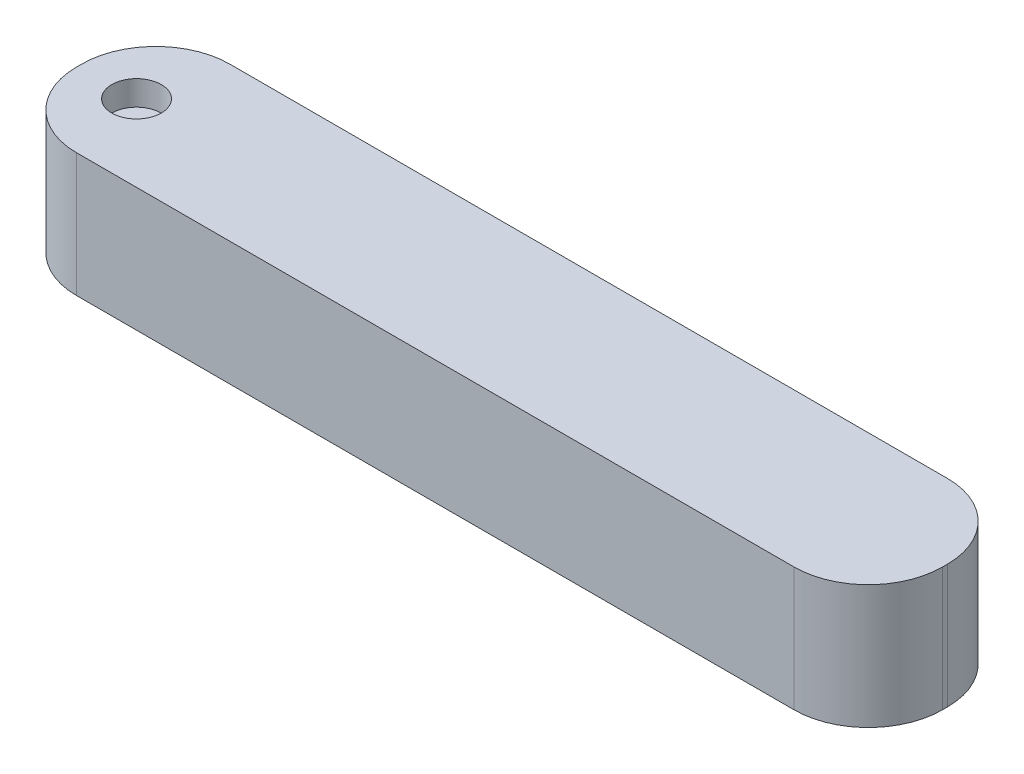
ISO-10303-21;
HEADER;
FILE_DESCRIPTION(('STEP AP214'),'2;1');
FILE_NAME('part.step','',(''),(''),'','','');
FILE_SCHEMA(('AUTOMOTIVE_DESIGN { 1 0 10303 214 1 1 1 1 }'));
ENDSEC;
DATA;
#1=APPLICATION_CONTEXT('core data for automotive mechanical design processes');
#2=APPLICATION_PROTOCOL_DEFINITION('international standard','automotive_design',2000,#1);
#3=PRODUCT_CONTEXT('',#1,'mechanical');
#4=PRODUCT('Part','Part','',(#3));
#5=PRODUCT_RELATED_PRODUCT_CATEGORY('part','',(#4));
#6=PRODUCT_DEFINITION_FORMATION('','',#4);
#7=PRODUCT_DEFINITION_CONTEXT('part definition',#1,'design');
#8=PRODUCT_DEFINITION('design','',#6,#7);
#9=PRODUCT_DEFINITION_SHAPE('','',#8);
#10=(LENGTH_UNIT() NAMED_UNIT(*) SI_UNIT(.MILLI.,.METRE.));
#11=(NAMED_UNIT(*) PLANE_ANGLE_UNIT() SI_UNIT($,.RADIAN.));
#12=(NAMED_UNIT(*) SI_UNIT($,.STERADIAN.) SOLID_ANGLE_UNIT());
#13=UNCERTAINTY_MEASURE_WITH_UNIT(LENGTH_MEASURE(1.E-05),#10,'distance_accuracy_value','');
#14=(GEOMETRIC_REPRESENTATION_CONTEXT(3) GLOBAL_UNCERTAINTY_ASSIGNED_CONTEXT((#13)) GLOBAL_UNIT_ASSIGNED_CONTEXT((#10,
#11,#12)) REPRESENTATION_CONTEXT('',''));
#15=CARTESIAN_POINT('',(0.,0.,0.));
#16=DIRECTION('',(0.,0.,1.));
#17=DIRECTION('',(1.,0.,0.));
#18=AXIS2_PLACEMENT_3D('',#15,#16,#17);
#19=CARTESIAN_POINT('',(-32.3318438914027,12.7,-11.1125));
#20=DIRECTION('',(1.,0.,0.));
#21=DIRECTION('',(0.,0.,-1.));
#22=AXIS2_PLACEMENT_3D('',#19,#20,#21);
#23=PLANE('',#22);
#24=DIRECTION('',(0.,0.,1.));
#25=VECTOR('',#24,1.);
#26=CARTESIAN_POINT('',(-32.3318438914027,12.7,-11.1125));
#27=LINE('',#26,#25);
#28=CARTESIAN_POINT('',(-32.3318438914027,12.7,-3.4925));
#29=VERTEX_POINT('',#28);
#30=CARTESIAN_POINT('',(-32.3318438914027,12.7,-2.9845));
#31=VERTEX_POINT('',#30);
#32=EDGE_CURVE('E129',#29,#31,#27,.T.);
#33=ORIENTED_EDGE('',*,*,#32,.F.);
#34=DIRECTION('',(0.,-1.,0.));
#35=VECTOR('',#34,1.);
#36=CARTESIAN_POINT('',(-32.3318438914027,12.7,-3.4925));
#37=LINE('',#36,#35);
#38=CARTESIAN_POINT('',(-32.3318438914027,0.,-3.4925));
#39=VERTEX_POINT('',#38);
#40=EDGE_CURVE('E113',#29,#39,#37,.T.);
#41=ORIENTED_EDGE('',*,*,#40,.T.);
#42=DIRECTION('',(0.,0.,1.));
#43=VECTOR('',#42,1.);
#44=CARTESIAN_POINT('',(-32.3318438914027,0.,-11.1125));
#45=LINE('',#44,#43);
#46=CARTESIAN_POINT('',(-32.3318438914027,0.,-2.9845));
#47=VERTEX_POINT('',#46);
#48=EDGE_CURVE('E126',#39,#47,#45,.T.);
#49=ORIENTED_EDGE('',*,*,#48,.T.);
#50=DIRECTION('',(0.,-1.,0.));
#51=VECTOR('',#50,1.);
#52=CARTESIAN_POINT('',(-32.3318438914027,12.7,-2.9845));
#53=LINE('',#52,#51);
#54=EDGE_CURVE('E132',#47,#31,#53,.F.);
#55=ORIENTED_EDGE('',*,*,#54,.T.);
#56=EDGE_LOOP('',(#33,#41,#49,#55));
#57=FACE_BOUND('',#56,.T.);
#58=ADVANCED_FACE('F42',(#57),#23,.F.);
#59=CARTESIAN_POINT('',(-32.3318438914027,12.7,4.6355));
#60=DIRECTION('',(0.,0.,-1.));
#61=DIRECTION('',(-1.,0.,0.));
#62=AXIS2_PLACEMENT_3D('',#59,#60,#61);
#63=PLANE('',#62);
#64=DIRECTION('',(1.,0.,0.));
#65=VECTOR('',#64,1.);
#66=CARTESIAN_POINT('',(-32.3318438914027,12.7,4.6355));
#67=LINE('',#66,#65);
#68=CARTESIAN_POINT('',(-24.7118438914027,12.7,4.6355));
#69=VERTEX_POINT('',#68);
#70=CARTESIAN_POINT('',(48.9481561085973,12.7,4.6355));
#71=VERTEX_POINT('',#70);
#72=EDGE_CURVE('E206',#69,#71,#67,.T.);
#73=ORIENTED_EDGE('',*,*,#72,.F.);
#74=DIRECTION('',(0.,-1.,0.));
#75=VECTOR('',#74,1.);
#76=CARTESIAN_POINT('',(-24.7118438914027,12.7,4.6355));
#77=LINE('',#76,#75);
#78=CARTESIAN_POINT('',(-24.7118438914027,0.,4.6355));
#79=VERTEX_POINT('',#78);
#80=EDGE_CURVE('E185',#69,#79,#77,.T.);
#81=ORIENTED_EDGE('',*,*,#80,.T.);
#82=DIRECTION('',(1.,0.,0.));
#83=VECTOR('',#82,1.);
#84=CARTESIAN_POINT('',(-32.3318438914027,0.,4.6355));
#85=LINE('',#84,#83);
#86=CARTESIAN_POINT('',(48.9481561085973,0.,4.6355));
#87=VERTEX_POINT('',#86);
#88=EDGE_CURVE('E137',#79,#87,#85,.T.);
#89=ORIENTED_EDGE('',*,*,#88,.T.);
#90=DIRECTION('',(0.,-1.,0.));
#91=VECTOR('',#90,1.);
#92=CARTESIAN_POINT('',(48.9481561085973,12.7,4.6355));
#93=LINE('',#92,#91);
#94=EDGE_CURVE('E182',#87,#71,#93,.F.);
#95=ORIENTED_EDGE('',*,*,#94,.T.);
#96=EDGE_LOOP('',(#73,#81,#89,#95));
#97=FACE_BOUND('',#96,.T.);
#98=ADVANCED_FACE('F262',(#97),#63,.F.);
#99=CARTESIAN_POINT('',(56.5681561085973,12.7,-11.1125));
#100=DIRECTION('',(-1.,0.,0.));
#101=DIRECTION('',(0.,0.,1.));
#102=AXIS2_PLACEMENT_3D('',#99,#100,#101);
#103=PLANE('',#102);
#104=DIRECTION('',(0.,0.,-1.));
#105=VECTOR('',#104,1.);
#106=CARTESIAN_POINT('',(56.5681561085973,0.,-11.1125));
#107=LINE('',#106,#105);
#108=CARTESIAN_POINT('',(56.5681561085973,0.,-2.9845));
#109=VERTEX_POINT('',#108);
#110=CARTESIAN_POINT('',(56.5681561085973,0.,-3.4925));
#111=VERTEX_POINT('',#110);
#112=EDGE_CURVE('E143',#109,#111,#107,.T.);
#113=ORIENTED_EDGE('',*,*,#112,.T.);
#114=DIRECTION('',(0.,-1.,0.));
#115=VECTOR('',#114,1.);
#116=CARTESIAN_POINT('',(56.5681561085973,12.7,-3.4925));
#117=LINE('',#116,#115);
#118=CARTESIAN_POINT('',(56.5681561085973,12.7,-3.4925));
#119=VERTEX_POINT('',#118);
#120=EDGE_CURVE('E11',#111,#119,#117,.F.);
#121=ORIENTED_EDGE('',*,*,#120,.T.);
#122=DIRECTION('',(0.,0.,-1.));
#123=VECTOR('',#122,1.);
#124=CARTESIAN_POINT('',(56.5681561085973,12.7,-11.1125));
#125=LINE('',#124,#123);
#126=CARTESIAN_POINT('',(56.5681561085973,12.7,-2.9845));
#127=VERTEX_POINT('',#126);
#128=EDGE_CURVE('E194',#127,#119,#125,.T.);
#129=ORIENTED_EDGE('',*,*,#128,.F.);
#130=DIRECTION('',(0.,-1.,0.));
#131=VECTOR('',#130,1.);
#132=CARTESIAN_POINT('',(56.5681561085973,12.7,-2.9845));
#133=LINE('',#132,#131);
#134=EDGE_CURVE('E52',#127,#109,#133,.T.);
#135=ORIENTED_EDGE('',*,*,#134,.T.);
#136=EDGE_LOOP('',(#113,#121,#129,#135));
#137=FACE_BOUND('',#136,.T.);
#138=ADVANCED_FACE('F193',(#137),#103,.F.);
#139=CARTESIAN_POINT('',(-32.3318438914027,12.7,-11.1125));
#140=DIRECTION('',(0.,0.,1.));
#141=DIRECTION('',(1.,0.,0.));
#142=AXIS2_PLACEMENT_3D('',#139,#140,#141);
#143=PLANE('',#142);
#144=DIRECTION('',(-1.,0.,0.));
#145=VECTOR('',#144,1.);
#146=CARTESIAN_POINT('',(-32.3318438914027,0.,-11.1125));
#147=LINE('',#146,#145);
#148=CARTESIAN_POINT('',(48.9481561085973,0.,-11.1125));
#149=VERTEX_POINT('',#148);
#150=CARTESIAN_POINT('',(-24.7118438914027,0.,-11.1125));
#151=VERTEX_POINT('',#150);
#152=EDGE_CURVE('E154',#149,#151,#147,.T.);
#153=ORIENTED_EDGE('',*,*,#152,.T.);
#154=DIRECTION('',(0.,-1.,0.));
#155=VECTOR('',#154,1.);
#156=CARTESIAN_POINT('',(-24.7118438914027,12.7,-11.1125));
#157=LINE('',#156,#155);
#158=CARTESIAN_POINT('',(-24.7118438914027,12.7,-11.1125));
#159=VERTEX_POINT('',#158);
#160=EDGE_CURVE('E114',#151,#159,#157,.F.);
#161=ORIENTED_EDGE('',*,*,#160,.T.);
#162=DIRECTION('',(-1.,0.,0.));
#163=VECTOR('',#162,1.);
#164=CARTESIAN_POINT('',(-32.3318438914027,12.7,-11.1125));
#165=LINE('',#164,#163);
#166=CARTESIAN_POINT('',(48.9481561085973,12.7,-11.1125));
#167=VERTEX_POINT('',#166);
#168=EDGE_CURVE('E149',#167,#159,#165,.T.);
#169=ORIENTED_EDGE('',*,*,#168,.F.);
#170=DIRECTION('',(0.,-1.,0.));
#171=VECTOR('',#170,1.);
#172=CARTESIAN_POINT('',(48.9481561085973,12.7,-11.1125));
#173=LINE('',#172,#171);
#174=EDGE_CURVE('E120',#167,#149,#173,.T.);
#175=ORIENTED_EDGE('',*,*,#174,.T.);
#176=EDGE_LOOP('',(#153,#161,#169,#175));
#177=FACE_BOUND('',#176,.T.);
#178=ADVANCED_FACE('F202',(#177),#143,.F.);
#179=CARTESIAN_POINT('',(0.,12.7,0.));
#180=DIRECTION('',(0.,1.,0.));
#181=DIRECTION('',(0.,0.,1.));
#182=AXIS2_PLACEMENT_3D('',#179,#180,#181);
#183=PLANE('',#182);
#184=CARTESIAN_POINT('',(-26.4287123427932,12.7,-3.2385));
#185=DIRECTION('',(0.,1.,0.));
#186=DIRECTION('',(0.,0.,1.));
#187=AXIS2_PLACEMENT_3D('',#184,#185,#186);
#188=CIRCLE('',#187,2.54);
#189=CARTESIAN_POINT('',(-26.4287123427932,12.7,-0.698499999999996));
#190=VERTEX_POINT('',#189);
#191=EDGE_CURVE('E146',#190,#190,#188,.T.);
#192=ORIENTED_EDGE('',*,*,#191,.F.);
#193=EDGE_LOOP('',(#192));
#194=FACE_BOUND('',#193,.T.);
#195=ORIENTED_EDGE('',*,*,#168,.T.);
#196=CARTESIAN_POINT('',(-24.7118438914027,12.7,-3.4925));
#197=DIRECTION('',(0.,1.,0.));
#198=DIRECTION('',(0.,0.,1.));
#199=AXIS2_PLACEMENT_3D('',#196,#197,#198);
#200=CIRCLE('',#199,7.62);
#201=EDGE_CURVE('E179',#159,#29,#200,.T.);
#202=ORIENTED_EDGE('',*,*,#201,.T.);
#203=ORIENTED_EDGE('',*,*,#32,.T.);
#204=CARTESIAN_POINT('',(-24.7118438914027,12.7,-2.9845));
#205=DIRECTION('',(0.,1.,0.));
#206=DIRECTION('',(0.,0.,1.));
#207=AXIS2_PLACEMENT_3D('',#204,#205,#206);
#208=CIRCLE('',#207,7.62);
#209=EDGE_CURVE('E176',#31,#69,#208,.T.);
#210=ORIENTED_EDGE('',*,*,#209,.T.);
#211=ORIENTED_EDGE('',*,*,#72,.T.);
#212=CARTESIAN_POINT('',(48.9481561085973,12.7,-2.9845));
#213=DIRECTION('',(0.,1.,0.));
#214=DIRECTION('',(0.,0.,1.));
#215=AXIS2_PLACEMENT_3D('',#212,#213,#214);
#216=CIRCLE('',#215,7.62);
#217=EDGE_CURVE('E64',#71,#127,#216,.T.);
#218=ORIENTED_EDGE('',*,*,#217,.T.);
#219=ORIENTED_EDGE('',*,*,#128,.T.);
#220=CARTESIAN_POINT('',(48.9481561085973,12.7,-3.4925));
#221=DIRECTION('',(0.,1.,0.));
#222=DIRECTION('',(0.,0.,1.));
#223=AXIS2_PLACEMENT_3D('',#220,#221,#222);
#224=CIRCLE('',#223,7.62);
#225=EDGE_CURVE('E173',#119,#167,#224,.T.);
#226=ORIENTED_EDGE('',*,*,#225,.T.);
#227=EDGE_LOOP('',(#195,#202,#203,#210,#211,#218,#219,#226));
#228=FACE_BOUND('',#227,.T.);
#229=ADVANCED_FACE('F248',(#194,#228),#183,.T.);
#230=CARTESIAN_POINT('',(0.,0.,0.));
#231=DIRECTION('',(0.,1.,0.));
#232=DIRECTION('',(0.,0.,1.));
#233=AXIS2_PLACEMENT_3D('',#230,#231,#232);
#234=PLANE('',#233);
#235=CARTESIAN_POINT('',(-26.4287123427932,0.,-3.2385));
#236=DIRECTION('',(0.,-1.,0.));
#237=DIRECTION('',(0.,0.,-1.));
#238=AXIS2_PLACEMENT_3D('',#235,#236,#237);
#239=CIRCLE('',#238,2.54);
#240=CARTESIAN_POINT('',(-26.4287123427932,0.,-5.7785));
#241=VERTEX_POINT('',#240);
#242=EDGE_CURVE('E216',#241,#241,#239,.T.);
#243=ORIENTED_EDGE('',*,*,#242,.F.);
#244=EDGE_LOOP('',(#243));
#245=FACE_BOUND('',#244,.T.);
#246=ORIENTED_EDGE('',*,*,#48,.F.);
#247=CARTESIAN_POINT('',(-24.7118438914027,0.,-3.4925));
#248=DIRECTION('',(0.,1.,0.));
#249=DIRECTION('',(0.,0.,1.));
#250=AXIS2_PLACEMENT_3D('',#247,#248,#249);
#251=CIRCLE('',#250,7.62);
#252=EDGE_CURVE('E109',#39,#151,#251,.F.);
#253=ORIENTED_EDGE('',*,*,#252,.T.);
#254=ORIENTED_EDGE('',*,*,#152,.F.);
#255=CARTESIAN_POINT('',(48.9481561085973,0.,-3.4925));
#256=DIRECTION('',(0.,1.,0.));
#257=DIRECTION('',(0.,0.,1.));
#258=AXIS2_PLACEMENT_3D('',#255,#256,#257);
#259=CIRCLE('',#258,7.62);
#260=EDGE_CURVE('E161',#149,#111,#259,.F.);
#261=ORIENTED_EDGE('',*,*,#260,.T.);
#262=ORIENTED_EDGE('',*,*,#112,.F.);
#263=CARTESIAN_POINT('',(48.9481561085973,0.,-2.9845));
#264=DIRECTION('',(0.,1.,0.));
#265=DIRECTION('',(0.,0.,1.));
#266=AXIS2_PLACEMENT_3D('',#263,#264,#265);
#267=CIRCLE('',#266,7.62);
#268=EDGE_CURVE('E131',#109,#87,#267,.F.);
#269=ORIENTED_EDGE('',*,*,#268,.T.);
#270=ORIENTED_EDGE('',*,*,#88,.F.);
#271=CARTESIAN_POINT('',(-24.7118438914027,0.,-2.9845));
#272=DIRECTION('',(0.,1.,0.));
#273=DIRECTION('',(0.,0.,1.));
#274=AXIS2_PLACEMENT_3D('',#271,#272,#273);
#275=CIRCLE('',#274,7.62);
#276=EDGE_CURVE('E121',#79,#47,#275,.F.);
#277=ORIENTED_EDGE('',*,*,#276,.T.);
#278=EDGE_LOOP('',(#246,#253,#254,#261,#262,#269,#270,#277));
#279=FACE_BOUND('',#278,.T.);
#280=ADVANCED_FACE('F134',(#245,#279),#234,.F.);
#281=CARTESIAN_POINT('',(-24.7118438914027,12.7,-3.4925));
#282=DIRECTION('',(0.,-1.,0.));
#283=DIRECTION('',(0.,0.,-1.));
#284=AXIS2_PLACEMENT_3D('',#281,#282,#283);
#285=CYLINDRICAL_SURFACE('',#284,7.62);
#286=ORIENTED_EDGE('',*,*,#201,.F.);
#287=ORIENTED_EDGE('',*,*,#160,.F.);
#288=ORIENTED_EDGE('',*,*,#252,.F.);
#289=ORIENTED_EDGE('',*,*,#40,.F.);
#290=EDGE_LOOP('',(#286,#287,#288,#289));
#291=FACE_BOUND('',#290,.T.);
#292=ADVANCED_FACE('F112',(#291),#285,.T.);
#293=CARTESIAN_POINT('',(-24.7118438914027,12.7,-2.9845));
#294=DIRECTION('',(0.,-1.,0.));
#295=DIRECTION('',(0.,0.,-1.));
#296=AXIS2_PLACEMENT_3D('',#293,#294,#295);
#297=CYLINDRICAL_SURFACE('',#296,7.62);
#298=ORIENTED_EDGE('',*,*,#209,.F.);
#299=ORIENTED_EDGE('',*,*,#54,.F.);
#300=ORIENTED_EDGE('',*,*,#276,.F.);
#301=ORIENTED_EDGE('',*,*,#80,.F.);
#302=EDGE_LOOP('',(#298,#299,#300,#301));
#303=FACE_BOUND('',#302,.T.);
#304=ADVANCED_FACE('F255',(#303),#297,.T.);
#305=CARTESIAN_POINT('',(48.9481561085973,12.7,-3.4925));
#306=DIRECTION('',(0.,-1.,0.));
#307=DIRECTION('',(0.,0.,-1.));
#308=AXIS2_PLACEMENT_3D('',#305,#306,#307);
#309=CYLINDRICAL_SURFACE('',#308,7.62);
#310=ORIENTED_EDGE('',*,*,#225,.F.);
#311=ORIENTED_EDGE('',*,*,#120,.F.);
#312=ORIENTED_EDGE('',*,*,#260,.F.);
#313=ORIENTED_EDGE('',*,*,#174,.F.);
#314=EDGE_LOOP('',(#310,#311,#312,#313));
#315=FACE_BOUND('',#314,.T.);
#316=ADVANCED_FACE('F199',(#315),#309,.T.);
#317=CARTESIAN_POINT('',(48.9481561085973,12.7,-2.9845));
#318=DIRECTION('',(0.,-1.,0.));
#319=DIRECTION('',(0.,0.,-1.));
#320=AXIS2_PLACEMENT_3D('',#317,#318,#319);
#321=CYLINDRICAL_SURFACE('',#320,7.62);
#322=ORIENTED_EDGE('',*,*,#217,.F.);
#323=ORIENTED_EDGE('',*,*,#94,.F.);
#324=ORIENTED_EDGE('',*,*,#268,.F.);
#325=ORIENTED_EDGE('',*,*,#134,.F.);
#326=EDGE_LOOP('',(#322,#323,#324,#325));
#327=FACE_BOUND('',#326,.T.);
#328=ADVANCED_FACE('F44',(#327),#321,.T.);
#329=CARTESIAN_POINT('',(-26.4287123427932,10.16,-3.2385));
#330=DIRECTION('',(0.,1.,0.));
#331=DIRECTION('',(0.,0.,1.));
#332=AXIS2_PLACEMENT_3D('',#329,#330,#331);
#333=CYLINDRICAL_SURFACE('',#332,2.54);
#334=CARTESIAN_POINT('',(-26.4287123427932,10.16,-3.2385));
#335=DIRECTION('',(0.,1.,0.));
#336=DIRECTION('',(0.,0.,1.));
#337=AXIS2_PLACEMENT_3D('',#334,#335,#336);
#338=CIRCLE('',#337,2.54);
#339=CARTESIAN_POINT('',(-26.4287123427932,10.16,-0.698499999999996));
#340=VERTEX_POINT('',#339);
#341=EDGE_CURVE('E138',#340,#340,#338,.T.);
#342=ORIENTED_EDGE('',*,*,#341,.F.);
#343=EDGE_LOOP('',(#342));
#344=FACE_BOUND('',#343,.T.);
#345=ORIENTED_EDGE('',*,*,#191,.T.);
#346=EDGE_LOOP('',(#345));
#347=FACE_BOUND('',#346,.T.);
#348=ADVANCED_FACE('F277',(#344,#347),#333,.F.);
#349=CARTESIAN_POINT('',(-26.4287123427932,10.16,-3.2385));
#350=DIRECTION('',(0.,1.,0.));
#351=DIRECTION('',(0.,0.,1.));
#352=AXIS2_PLACEMENT_3D('',#349,#350,#351);
#353=PLANE('',#352);
#354=CARTESIAN_POINT('',(-26.4287123427932,10.16,-3.2385));
#355=DIRECTION('',(0.,1.,0.));
#356=DIRECTION('',(0.,0.,1.));
#357=AXIS2_PLACEMENT_3D('',#354,#355,#356);
#358=CIRCLE('',#357,1.016);
#359=CARTESIAN_POINT('',(-26.4287123427932,10.16,-2.2225));
#360=VERTEX_POINT('',#359);
#361=EDGE_CURVE('E223',#360,#360,#358,.T.);
#362=ORIENTED_EDGE('',*,*,#361,.F.);
#363=EDGE_LOOP('',(#362));
#364=FACE_BOUND('',#363,.T.);
#365=ORIENTED_EDGE('',*,*,#341,.T.);
#366=EDGE_LOOP('',(#365));
#367=FACE_BOUND('',#366,.T.);
#368=ADVANCED_FACE('F243',(#364,#367),#353,.T.);
#369=CARTESIAN_POINT('',(-26.4287123427932,7.62,-3.2385));
#370=DIRECTION('',(0.,-1.,0.));
#371=DIRECTION('',(0.,0.,-1.));
#372=AXIS2_PLACEMENT_3D('',#369,#370,#371);
#373=CYLINDRICAL_SURFACE('',#372,2.54);
#374=CARTESIAN_POINT('',(-26.4287123427932,7.62,-3.2385));
#375=DIRECTION('',(0.,-1.,0.));
#376=DIRECTION('',(0.,0.,-1.));
#377=AXIS2_PLACEMENT_3D('',#374,#375,#376);
#378=CIRCLE('',#377,2.54);
#379=CARTESIAN_POINT('',(-26.4287123427932,7.62,-5.7785));
#380=VERTEX_POINT('',#379);
#381=EDGE_CURVE('E214',#380,#380,#378,.T.);
#382=ORIENTED_EDGE('',*,*,#381,.F.);
#383=EDGE_LOOP('',(#382));
#384=FACE_BOUND('',#383,.T.);
#385=ORIENTED_EDGE('',*,*,#242,.T.);
#386=EDGE_LOOP('',(#385));
#387=FACE_BOUND('',#386,.T.);
#388=ADVANCED_FACE('F237',(#384,#387),#373,.F.);
#389=CARTESIAN_POINT('',(-26.4287123427932,7.62,-3.2385));
#390=DIRECTION('',(0.,-1.,0.));
#391=DIRECTION('',(0.,0.,-1.));
#392=AXIS2_PLACEMENT_3D('',#389,#390,#391);
#393=PLANE('',#392);
#394=CARTESIAN_POINT('',(-26.4287123427932,7.62,-3.2385));
#395=DIRECTION('',(0.,-1.,0.));
#396=DIRECTION('',(0.,0.,-1.));
#397=AXIS2_PLACEMENT_3D('',#394,#395,#396);
#398=CIRCLE('',#397,1.016);
#399=CARTESIAN_POINT('',(-26.4287123427932,7.62,-4.2545));
#400=VERTEX_POINT('',#399);
#401=EDGE_CURVE('E46',#400,#400,#398,.T.);
#402=ORIENTED_EDGE('',*,*,#401,.F.);
#403=EDGE_LOOP('',(#402));
#404=FACE_BOUND('',#403,.T.);
#405=ORIENTED_EDGE('',*,*,#381,.T.);
#406=EDGE_LOOP('',(#405));
#407=FACE_BOUND('',#406,.T.);
#408=ADVANCED_FACE('F234',(#404,#407),#393,.T.);
#409=CARTESIAN_POINT('',(-26.4287123427932,5.08,-3.2385));
#410=DIRECTION('',(0.,1.,0.));
#411=DIRECTION('',(0.,0.,1.));
#412=AXIS2_PLACEMENT_3D('',#409,#410,#411);
#413=CYLINDRICAL_SURFACE('',#412,1.016);
#414=ORIENTED_EDGE('',*,*,#401,.T.);
#415=EDGE_LOOP('',(#414));
#416=FACE_BOUND('',#415,.T.);
#417=ORIENTED_EDGE('',*,*,#361,.T.);
#418=EDGE_LOOP('',(#417));
#419=FACE_BOUND('',#418,.T.);
#420=ADVANCED_FACE('F232',(#416,#419),#413,.F.);
#421=CLOSED_SHELL('',(#58,#98,#138,#178,#229,#280,#292,#304,#316,#328,#348,#368,#388,#408,#420));
#422=MANIFOLD_SOLID_BREP('B2',#421);
#423=ADVANCED_BREP_SHAPE_REPRESENTATION('',(#18,#422),#14);
#424=SHAPE_DEFINITION_REPRESENTATION(#9,#423);
ENDSEC;
END-ISO-10303-21;
